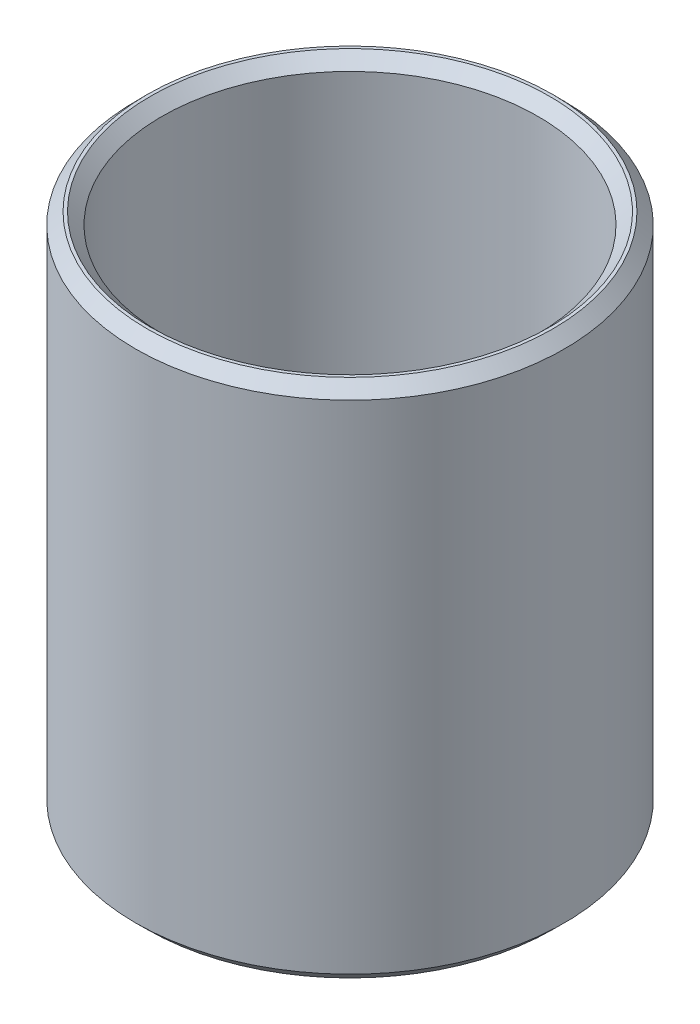
ISO-10303-21;
HEADER;
FILE_DESCRIPTION(('STEP AP214'),'2;1');
FILE_NAME('part.step','',(''),(''),'','','');
FILE_SCHEMA(('AUTOMOTIVE_DESIGN { 1 0 10303 214 1 1 1 1 }'));
ENDSEC;
DATA;
#1=APPLICATION_CONTEXT('core data for automotive mechanical design processes');
#2=APPLICATION_PROTOCOL_DEFINITION('international standard','automotive_design',2000,#1);
#3=PRODUCT_CONTEXT('',#1,'mechanical');
#4=PRODUCT('Part','Part','',(#3));
#5=PRODUCT_RELATED_PRODUCT_CATEGORY('part','',(#4));
#6=PRODUCT_DEFINITION_FORMATION('','',#4);
#7=PRODUCT_DEFINITION_CONTEXT('part definition',#1,'design');
#8=PRODUCT_DEFINITION('design','',#6,#7);
#9=PRODUCT_DEFINITION_SHAPE('','',#8);
#10=(LENGTH_UNIT() NAMED_UNIT(*) SI_UNIT(.MILLI.,.METRE.));
#11=(NAMED_UNIT(*) PLANE_ANGLE_UNIT() SI_UNIT($,.RADIAN.));
#12=(NAMED_UNIT(*) SI_UNIT($,.STERADIAN.) SOLID_ANGLE_UNIT());
#13=UNCERTAINTY_MEASURE_WITH_UNIT(LENGTH_MEASURE(1.E-05),#10,'distance_accuracy_value','');
#14=(GEOMETRIC_REPRESENTATION_CONTEXT(3) GLOBAL_UNCERTAINTY_ASSIGNED_CONTEXT((#13)) GLOBAL_UNIT_ASSIGNED_CONTEXT((#10,
#11,#12)) REPRESENTATION_CONTEXT('',''));
#15=CARTESIAN_POINT('',(0.,0.,0.));
#16=DIRECTION('',(0.,0.,1.));
#17=DIRECTION('',(1.,0.,0.));
#18=AXIS2_PLACEMENT_3D('',#15,#16,#17);
#19=CARTESIAN_POINT('',(0.,78.8467376511049,0.));
#20=DIRECTION('',(0.,-1.,0.));
#21=DIRECTION('',(0.,0.,-1.));
#22=AXIS2_PLACEMENT_3D('',#19,#20,#21);
#23=CYLINDRICAL_SURFACE('',#22,32.5);
#24=CARTESIAN_POINT('',(0.,1.74491046083552,0.));
#25=DIRECTION('',(0.,1.,0.));
#26=DIRECTION('',(0.,0.,1.));
#27=AXIS2_PLACEMENT_3D('',#24,#25,#26);
#28=CIRCLE('',#27,32.5);
#29=CARTESIAN_POINT('',(0.,1.74491046083552,32.5));
#30=VERTEX_POINT('',#29);
#31=EDGE_CURVE('E10',#30,#30,#28,.T.);
#32=ORIENTED_EDGE('',*,*,#31,.T.);
#33=EDGE_LOOP('',(#32));
#34=FACE_BOUND('',#33,.T.);
#35=CARTESIAN_POINT('',(0.,77.0786988544299,0.));
#36=DIRECTION('',(0.,1.,0.));
#37=DIRECTION('',(0.,0.,1.));
#38=AXIS2_PLACEMENT_3D('',#35,#36,#37);
#39=CIRCLE('',#38,32.5);
#40=CARTESIAN_POINT('',(0.,77.0786988544299,32.5));
#41=VERTEX_POINT('',#40);
#42=EDGE_CURVE('E50',#41,#41,#39,.F.);
#43=ORIENTED_EDGE('',*,*,#42,.T.);
#44=EDGE_LOOP('',(#43));
#45=FACE_BOUND('',#44,.T.);
#46=ADVANCED_FACE('F39',(#34,#45),#23,.T.);
#47=CARTESIAN_POINT('',(0.,78.8467376511049,0.));
#48=DIRECTION('',(0.,1.,0.));
#49=DIRECTION('',(0.,0.,1.));
#50=AXIS2_PLACEMENT_3D('',#47,#48,#49);
#51=PLANE('',#50);
#52=CARTESIAN_POINT('',(0.,78.8467376511049,0.));
#53=DIRECTION('',(0.,1.,0.));
#54=DIRECTION('',(0.,0.,1.));
#55=AXIS2_PLACEMENT_3D('',#52,#53,#54);
#56=CIRCLE('',#55,30.2786973064438);
#57=CARTESIAN_POINT('',(0.,78.8467376511049,30.2786973064438));
#58=VERTEX_POINT('',#57);
#59=EDGE_CURVE('E58',#58,#58,#56,.F.);
#60=ORIENTED_EDGE('',*,*,#59,.T.);
#61=EDGE_LOOP('',(#60));
#62=FACE_BOUND('',#61,.T.);
#63=CARTESIAN_POINT('',(0.,78.8467376511049,0.));
#64=DIRECTION('',(0.,1.,0.));
#65=DIRECTION('',(0.,0.,1.));
#66=AXIS2_PLACEMENT_3D('',#63,#64,#65);
#67=CIRCLE('',#66,30.7550895391645);
#68=CARTESIAN_POINT('',(0.,78.8467376511049,30.7550895391645));
#69=VERTEX_POINT('',#68);
#70=EDGE_CURVE('E61',#69,#69,#67,.T.);
#71=ORIENTED_EDGE('',*,*,#70,.T.);
#72=EDGE_LOOP('',(#71));
#73=FACE_BOUND('',#72,.T.);
#74=ADVANCED_FACE('F88',(#62,#73),#51,.T.);
#75=CARTESIAN_POINT('',(0.,0.,0.));
#76=DIRECTION('',(0.,1.,0.));
#77=DIRECTION('',(0.,0.,1.));
#78=AXIS2_PLACEMENT_3D('',#75,#76,#77);
#79=PLANE('',#78);
#80=CARTESIAN_POINT('',(0.,0.,0.));
#81=DIRECTION('',(0.,1.,0.));
#82=DIRECTION('',(0.,0.,1.));
#83=AXIS2_PLACEMENT_3D('',#80,#81,#82);
#84=CIRCLE('',#83,30.2555689706043);
#85=CARTESIAN_POINT('',(0.,0.,30.2555689706043));
#86=VERTEX_POINT('',#85);
#87=EDGE_CURVE('E51',#86,#86,#84,.T.);
#88=ORIENTED_EDGE('',*,*,#87,.T.);
#89=EDGE_LOOP('',(#88));
#90=FACE_BOUND('',#89,.T.);
#91=CARTESIAN_POINT('',(0.,0.,0.));
#92=DIRECTION('',(0.,1.,0.));
#93=DIRECTION('',(0.,0.,1.));
#94=AXIS2_PLACEMENT_3D('',#91,#92,#93);
#95=CIRCLE('',#94,30.731961203325);
#96=CARTESIAN_POINT('',(0.,0.,30.731961203325));
#97=VERTEX_POINT('',#96);
#98=EDGE_CURVE('E54',#97,#97,#95,.F.);
#99=ORIENTED_EDGE('',*,*,#98,.T.);
#100=EDGE_LOOP('',(#99));
#101=FACE_BOUND('',#100,.T.);
#102=ADVANCED_FACE('F83',(#90,#101),#79,.F.);
#103=CARTESIAN_POINT('',(0.,78.8467376511049,0.));
#104=DIRECTION('',(0.,-1.,0.));
#105=DIRECTION('',(0.,0.,-1.));
#106=AXIS2_PLACEMENT_3D('',#103,#104,#105);
#107=CYLINDRICAL_SURFACE('',#106,28.5106585097688);
#108=CARTESIAN_POINT('',(0.,77.1018271902694,0.));
#109=DIRECTION('',(0.,1.,0.));
#110=DIRECTION('',(0.,0.,1.));
#111=AXIS2_PLACEMENT_3D('',#108,#109,#110);
#112=CIRCLE('',#111,28.5106585097688);
#113=CARTESIAN_POINT('',(0.,77.1018271902694,28.5106585097688));
#114=VERTEX_POINT('',#113);
#115=EDGE_CURVE('E67',#114,#114,#112,.T.);
#116=ORIENTED_EDGE('',*,*,#115,.T.);
#117=EDGE_LOOP('',(#116));
#118=FACE_BOUND('',#117,.T.);
#119=CARTESIAN_POINT('',(0.,1.76803879667506,0.));
#120=DIRECTION('',(0.,1.,0.));
#121=DIRECTION('',(0.,0.,1.));
#122=AXIS2_PLACEMENT_3D('',#119,#120,#121);
#123=CIRCLE('',#122,28.5106585097688);
#124=CARTESIAN_POINT('',(0.,1.76803879667506,28.5106585097688));
#125=VERTEX_POINT('',#124);
#126=EDGE_CURVE('E69',#125,#125,#123,.F.);
#127=ORIENTED_EDGE('',*,*,#126,.T.);
#128=EDGE_LOOP('',(#127));
#129=FACE_BOUND('',#128,.T.);
#130=ADVANCED_FACE('F71',(#118,#129),#107,.F.);
#131=CARTESIAN_POINT('',(0.,77.1018271902694,0.));
#132=DIRECTION('',(0.,1.,0.));
#133=DIRECTION('',(0.,0.,1.));
#134=AXIS2_PLACEMENT_3D('',#131,#132,#133);
#135=CONICAL_SURFACE('',#134,28.5106585097688,0.791981805796559);
#136=ORIENTED_EDGE('',*,*,#59,.F.);
#137=EDGE_LOOP('',(#136));
#138=FACE_BOUND('',#137,.T.);
#139=ORIENTED_EDGE('',*,*,#115,.F.);
#140=EDGE_LOOP('',(#139));
#141=FACE_BOUND('',#140,.T.);
#142=ADVANCED_FACE('F77',(#138,#141),#135,.F.);
#143=CARTESIAN_POINT('',(0.,0.,0.));
#144=DIRECTION('',(0.,-1.,0.));
#145=DIRECTION('',(0.,0.,-1.));
#146=AXIS2_PLACEMENT_3D('',#143,#144,#145);
#147=CONICAL_SURFACE('',#146,30.2555689706043,0.77881452099833);
#148=ORIENTED_EDGE('',*,*,#126,.F.);
#149=EDGE_LOOP('',(#148));
#150=FACE_BOUND('',#149,.T.);
#151=ORIENTED_EDGE('',*,*,#87,.F.);
#152=EDGE_LOOP('',(#151));
#153=FACE_BOUND('',#152,.T.);
#154=ADVANCED_FACE('F73',(#150,#153),#147,.F.);
#155=CARTESIAN_POINT('',(0.,1.74491046083552,0.));
#156=DIRECTION('',(0.,1.,0.));
#157=DIRECTION('',(0.,0.,1.));
#158=AXIS2_PLACEMENT_3D('',#155,#156,#157);
#159=CONICAL_SURFACE('',#158,32.5,0.791981805796562);
#160=ORIENTED_EDGE('',*,*,#98,.F.);
#161=EDGE_LOOP('',(#160));
#162=FACE_BOUND('',#161,.T.);
#163=ORIENTED_EDGE('',*,*,#31,.F.);
#164=EDGE_LOOP('',(#163));
#165=FACE_BOUND('',#164,.T.);
#166=ADVANCED_FACE('F76',(#162,#165),#159,.T.);
#167=CARTESIAN_POINT('',(0.,78.8467376511049,0.));
#168=DIRECTION('',(0.,-1.,0.));
#169=DIRECTION('',(0.,0.,-1.));
#170=AXIS2_PLACEMENT_3D('',#167,#168,#169);
#171=CONICAL_SURFACE('',#170,30.7550895391645,0.778814520998331);
#172=ORIENTED_EDGE('',*,*,#42,.F.);
#173=EDGE_LOOP('',(#172));
#174=FACE_BOUND('',#173,.T.);
#175=ORIENTED_EDGE('',*,*,#70,.F.);
#176=EDGE_LOOP('',(#175));
#177=FACE_BOUND('',#176,.T.);
#178=ADVANCED_FACE('F45',(#174,#177),#171,.T.);
#179=CLOSED_SHELL('',(#46,#74,#102,#130,#142,#154,#166,#178));
#180=MANIFOLD_SOLID_BREP('B2',#179);
#181=ADVANCED_BREP_SHAPE_REPRESENTATION('',(#18,#180),#14);
#182=SHAPE_DEFINITION_REPRESENTATION(#9,#181);
ENDSEC;
END-ISO-10303-21;
